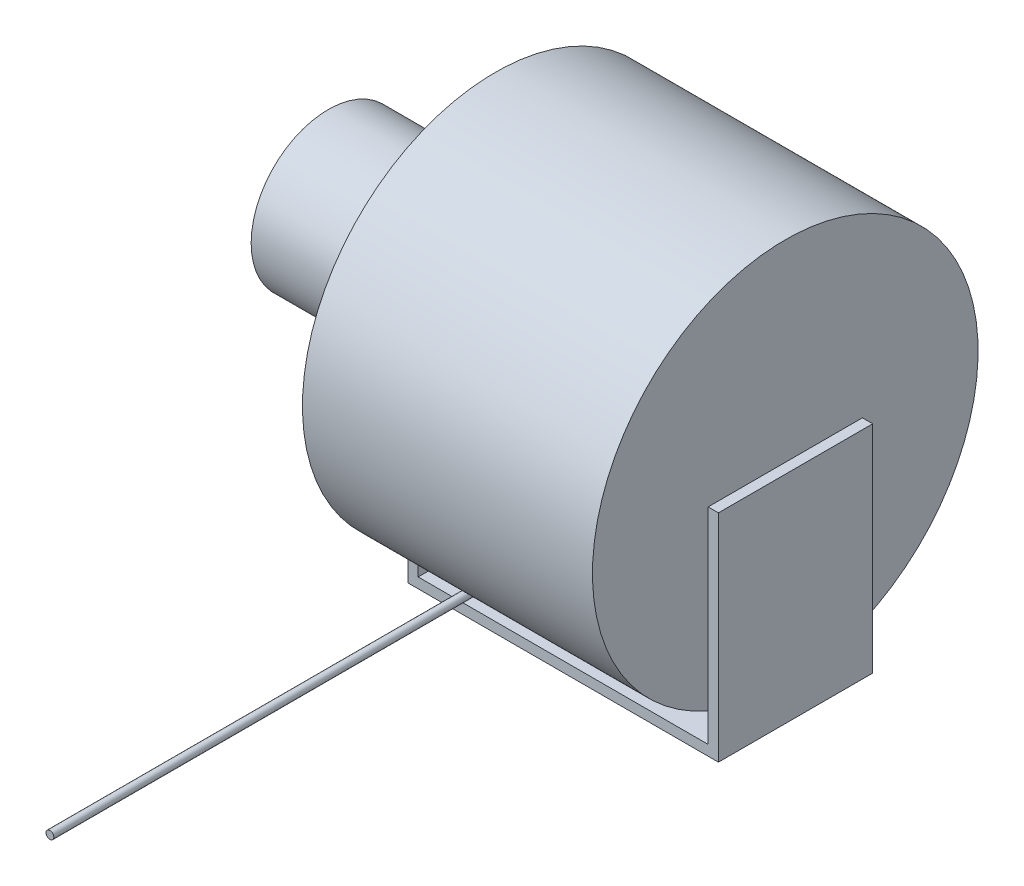
ISO-10303-21;
HEADER;
FILE_DESCRIPTION(('STEP AP214'),'2;1');
FILE_NAME('part.step','',(''),(''),'','','');
FILE_SCHEMA(('AUTOMOTIVE_DESIGN { 1 0 10303 214 1 1 1 1 }'));
ENDSEC;
DATA;
#1=APPLICATION_CONTEXT('core data for automotive mechanical design processes');
#2=APPLICATION_PROTOCOL_DEFINITION('international standard','automotive_design',2000,#1);
#3=PRODUCT_CONTEXT('',#1,'mechanical');
#4=PRODUCT('Part','Part','',(#3));
#5=PRODUCT_RELATED_PRODUCT_CATEGORY('part','',(#4));
#6=PRODUCT_DEFINITION_FORMATION('','',#4);
#7=PRODUCT_DEFINITION_CONTEXT('part definition',#1,'design');
#8=PRODUCT_DEFINITION('design','',#6,#7);
#9=PRODUCT_DEFINITION_SHAPE('','',#8);
#10=(LENGTH_UNIT() NAMED_UNIT(*) SI_UNIT(.MILLI.,.METRE.));
#11=(NAMED_UNIT(*) PLANE_ANGLE_UNIT() SI_UNIT($,.RADIAN.));
#12=(NAMED_UNIT(*) SI_UNIT($,.STERADIAN.) SOLID_ANGLE_UNIT());
#13=UNCERTAINTY_MEASURE_WITH_UNIT(LENGTH_MEASURE(1.E-05),#10,'distance_accuracy_value','');
#14=(GEOMETRIC_REPRESENTATION_CONTEXT(3) GLOBAL_UNCERTAINTY_ASSIGNED_CONTEXT((#13)) GLOBAL_UNIT_ASSIGNED_CONTEXT((#10,
#11,#12)) REPRESENTATION_CONTEXT('',''));
#15=CARTESIAN_POINT('',(0.,0.,0.));
#16=DIRECTION('',(0.,0.,1.));
#17=DIRECTION('',(1.,0.,0.));
#18=AXIS2_PLACEMENT_3D('',#15,#16,#17);
#19=CARTESIAN_POINT('',(282.,0.,0.));
#20=DIRECTION('',(-1.,0.,0.));
#21=DIRECTION('',(0.,0.,1.));
#22=AXIS2_PLACEMENT_3D('',#19,#20,#21);
#23=CYLINDRICAL_SURFACE('',#22,187.5);
#24=CARTESIAN_POINT('',(0.,0.,0.));
#25=DIRECTION('',(1.,0.,0.));
#26=DIRECTION('',(0.,0.,-1.));
#27=AXIS2_PLACEMENT_3D('',#24,#25,#26);
#28=CIRCLE('',#27,187.5);
#29=CARTESIAN_POINT('',(0.,-171.846588560844,75.));
#30=VERTEX_POINT('',#29);
#31=CARTESIAN_POINT('',(0.,-171.846588560844,-75.));
#32=VERTEX_POINT('',#31);
#33=EDGE_CURVE('E142',#30,#32,#28,.T.);
#34=ORIENTED_EDGE('',*,*,#33,.T.);
#35=EDGE_CURVE('E213',#32,#30,#28,.T.);
#36=ORIENTED_EDGE('',*,*,#35,.T.);
#37=EDGE_LOOP('',(#34,#36));
#38=FACE_BOUND('',#37,.T.);
#39=CARTESIAN_POINT('',(282.,0.,0.));
#40=DIRECTION('',(1.,0.,0.));
#41=DIRECTION('',(0.,0.,-1.));
#42=AXIS2_PLACEMENT_3D('',#39,#40,#41);
#43=CIRCLE('',#42,187.5);
#44=CARTESIAN_POINT('',(282.,-171.846588560844,75.));
#45=VERTEX_POINT('',#44);
#46=CARTESIAN_POINT('',(282.,-171.846588560844,-75.));
#47=VERTEX_POINT('',#46);
#48=EDGE_CURVE('E147',#45,#47,#43,.T.);
#49=ORIENTED_EDGE('',*,*,#48,.F.);
#50=EDGE_CURVE('E149',#47,#45,#43,.T.);
#51=ORIENTED_EDGE('',*,*,#50,.F.);
#52=EDGE_LOOP('',(#49,#51));
#53=FACE_BOUND('',#52,.T.);
#54=DIRECTION('',(-1.,0.,0.));
#55=VECTOR('',#54,1.);
#56=CARTESIAN_POINT('',(282.,-187.5,0.));
#57=LINE('',#56,#55);
#58=CARTESIAN_POINT('',(46.9,-187.5,0.));
#59=VERTEX_POINT('',#58);
#60=CARTESIAN_POINT('',(54.5,-187.5,0.));
#61=VERTEX_POINT('',#60);
#62=EDGE_CURVE('E11',#59,#61,#57,.F.);
#63=ORIENTED_EDGE('',*,*,#62,.F.);
#64=CARTESIAN_POINT('',(46.9,-187.5,0.));
#65=CARTESIAN_POINT('',(46.9000175227224,-187.500000118427,0.633424812997979));
#66=CARTESIAN_POINT('',(46.9000006280459,-187.496790188283,1.26684962907383));
#67=CARTESIAN_POINT('',(46.9000237731408,-187.483951127179,2.5336296179236));
#68=CARTESIAN_POINT('',(46.9000638125003,-187.474322042639,3.16698479116803));
#69=CARTESIAN_POINT('',(46.9003266265551,-187.44864214647,4.43373383816912));
#70=CARTESIAN_POINT('',(46.9005494499634,-187.432589623542,5.06712767722959));
#71=CARTESIAN_POINT('',(46.9014277037287,-187.394064401529,6.33372458783348));
#72=CARTESIAN_POINT('',(46.902083137326,-187.371591654358,6.96692765791251));
#73=CARTESIAN_POINT('',(46.9041686343201,-187.320207365941,8.23359033330876));
#74=CARTESIAN_POINT('',(46.9055993310942,-187.291290571403,8.86704972461046));
#75=CARTESIAN_POINT('',(46.909680058909,-187.227031872245,10.1336385259811));
#76=CARTESIAN_POINT('',(46.9123300891885,-187.191689971636,10.7667679362558));
#77=CARTESIAN_POINT('',(46.9193978177746,-187.114582757247,12.0326661754178));
#78=CARTESIAN_POINT('',(46.9238156273283,-187.072817039316,12.6654349791018));
#79=CARTESIAN_POINT('',(46.935078853708,-186.982869690701,13.9304899895));
#80=CARTESIAN_POINT('',(46.941924248713,-186.934688117692,14.5627762005009));
#81=CARTESIAN_POINT('',(46.9588277423088,-186.831910366129,15.8268578519086));
#82=CARTESIAN_POINT('',(46.9688862058321,-186.777313459383,16.4586532283927));
#83=CARTESIAN_POINT('',(46.993144654552,-186.661720468519,17.7215740820794));
#84=CARTESIAN_POINT('',(47.0073445954072,-186.600724452918,18.3526995663816));
#85=CARTESIAN_POINT('',(47.0409909484241,-186.47235320213,19.6141113214793));
#86=CARTESIAN_POINT('',(47.0604369204357,-186.404978502432,20.2443976582242));
#87=CARTESIAN_POINT('',(47.1059104672734,-186.263869446385,21.5040127127352));
#88=CARTESIAN_POINT('',(47.1319379144217,-186.190135213427,22.1333414488402));
#89=CARTESIAN_POINT('',(47.1922250260151,-186.036323744766,23.3909734988482));
#90=CARTESIAN_POINT('',(47.2264864383462,-185.956245164724,24.0192765664756));
#91=CARTESIAN_POINT('',(47.3053376479183,-185.789809595233,25.2744428144783));
#92=CARTESIAN_POINT('',(47.3499279670798,-185.703452288671,25.9013059204751));
#93=CARTESIAN_POINT('',(47.4521660307478,-185.524593796126,27.1527966565233));
#94=CARTESIAN_POINT('',(47.5098071047782,-185.432095765788,27.7774252635706));
#95=CARTESIAN_POINT('',(47.6090272384858,-185.288839581068,28.7122855507101));
#96=CARTESIAN_POINT('',(47.6442251265458,-185.240338328345,29.0235442889877));
#97=CARTESIAN_POINT('',(47.7195560669423,-185.141863222087,29.6452274269418));
#98=CARTESIAN_POINT('',(47.7596889704669,-185.091889412991,29.9556518514882));
#99=CARTESIAN_POINT('',(47.8368997166248,-185.000911234695,30.5118853593869));
#100=CARTESIAN_POINT('',(47.8729150825413,-184.960170153332,30.75788480885));
#101=CARTESIAN_POINT('',(47.9491292635967,-184.877813697329,31.2490962600432));
#102=CARTESIAN_POINT('',(47.9893281472523,-184.83619830838,31.4943082488085));
#103=CARTESIAN_POINT('',(48.0745860894121,-184.752130163623,31.9837781847891));
#104=CARTESIAN_POINT('',(48.1196457317196,-184.709677307733,32.2280360137458));
#105=CARTESIAN_POINT('',(48.2154957867499,-184.624000377655,32.7152817902279));
#106=CARTESIAN_POINT('',(48.2662858650524,-184.580776348596,32.9582698109924));
#107=CARTESIAN_POINT('',(48.380641673839,-184.488931853758,33.468766803443));
#108=CARTESIAN_POINT('',(48.4449949458466,-184.440233146771,33.7360869241299));
#109=CARTESIAN_POINT('',(48.5844146406632,-184.342215939266,34.2676280204506));
#110=CARTESIAN_POINT('',(48.659472377047,-184.292897970573,34.5318513227564));
#111=CARTESIAN_POINT('',(48.8006862682495,-184.207993296485,34.9814482347491));
#112=CARTESIAN_POINT('',(48.8633307082428,-184.172478738763,35.1679337032945));
#113=CARTESIAN_POINT('',(48.9983159304479,-184.101448430047,35.537897509482));
#114=CARTESIAN_POINT('',(49.0706762301309,-184.065932824379,35.7213689374434));
#115=CARTESIAN_POINT('',(49.1898346988285,-184.012691302289,35.9942815203375));
#116=CARTESIAN_POINT('',(49.2318073545479,-183.994767201168,36.0857890354431));
#117=CARTESIAN_POINT('',(49.3198694101712,-183.959166183016,36.2668398533476));
#118=CARTESIAN_POINT('',(49.3659576958688,-183.941489200573,36.3563836796396));
#119=CARTESIAN_POINT('',(49.4630338172272,-183.906593896846,36.5324890077432));
#120=CARTESIAN_POINT('',(49.5140048106772,-183.889374243214,36.6190594549194));
#121=CARTESIAN_POINT('',(49.6222432922106,-183.855598029672,36.7882655751723));
#122=CARTESIAN_POINT('',(49.6795040779299,-183.839040789087,36.8709053047388));
#123=CARTESIAN_POINT('',(49.7825327770056,-183.812168740642,37.004589945318));
#124=CARTESIAN_POINT('',(49.8260932202921,-183.801555574333,37.0572645070285));
#125=CARTESIAN_POINT('',(49.9178710647589,-183.781063099838,37.1587610442549));
#126=CARTESIAN_POINT('',(49.9660952442078,-183.771184897863,37.207577219042));
#127=CARTESIAN_POINT('',(50.0685668308293,-183.752462196119,37.2999313078702));
#128=CARTESIAN_POINT('',(50.1228713822368,-183.743629445886,37.3434094004902));
#129=CARTESIAN_POINT('',(50.237855072621,-183.727764398756,37.4213864989811));
#130=CARTESIAN_POINT('',(50.2985144507622,-183.72072674132,37.4559122437552));
#131=CARTESIAN_POINT('',(50.4041240396474,-183.711303231501,37.5020989119028));
#132=CARTESIAN_POINT('',(50.4473336239034,-183.708149731975,37.5175407887689));
#133=CARTESIAN_POINT('',(50.5357438274487,-183.70329469982,37.5413061287009));
#134=CARTESIAN_POINT('',(50.5809416540527,-183.701591194956,37.5496392608837));
#135=CARTESIAN_POINT('',(50.6723894459548,-183.699824183431,37.5582829443736));
#136=CARTESIAN_POINT('',(50.7186436246996,-183.699769150131,37.5585520454962));
#137=CARTESIAN_POINT('',(50.8104521898261,-183.701327357977,37.5509299446128));
#138=CARTESIAN_POINT('',(50.8560060435364,-183.702941810847,37.5430328155029));
#139=CARTESIAN_POINT('',(50.9529563631979,-183.708065366303,37.5179544398588));
#140=CARTESIAN_POINT('',(51.0039722722083,-183.71185762876,37.4993852282633));
#141=CARTESIAN_POINT('',(51.1022631436586,-183.721027228395,37.4544347247472));
#142=CARTESIAN_POINT('',(51.1495305977625,-183.72640764982,37.4280382315717));
#143=CARTESIAN_POINT('',(51.2689338423281,-183.742086032769,37.3510128401832));
#144=CARTESIAN_POINT('',(51.3378342198039,-183.753338886146,37.2956314850664));
#145=CARTESIAN_POINT('',(51.4668706691513,-183.777604667336,37.1758766975226));
#146=CARTESIAN_POINT('',(51.5269802095517,-183.79062270369,37.1114771475211));
#147=CARTESIAN_POINT('',(51.6631969289159,-183.82318515852,36.9499096360391));
#148=CARTESIAN_POINT('',(51.7359252923916,-183.843237676007,36.8500326500083));
#149=CARTESIAN_POINT('',(51.8715856667969,-183.884424651442,36.6439559446666));
#150=CARTESIAN_POINT('',(51.9344959211616,-183.905561378118,36.5377428845088));
#151=CARTESIAN_POINT('',(52.0531708060053,-183.948532035889,36.3207909940691));
#152=CARTESIAN_POINT('',(52.1088941093218,-183.97036916952,36.2100304322557));
#153=CARTESIAN_POINT('',(52.2143884169079,-184.014331885211,35.985951378689));
#154=CARTESIAN_POINT('',(52.2641656973889,-184.036457135292,35.8726357368616));
#155=CARTESIAN_POINT('',(52.3570134753616,-184.079938451611,35.6488248413724));
#156=CARTESIAN_POINT('',(52.4002765629782,-184.101288338924,35.5384076676429));
#157=CARTESIAN_POINT('',(52.4831703750277,-184.144039394178,35.3162224050906));
#158=CARTESIAN_POINT('',(52.5228006731952,-184.165440567835,35.2044541594725));
#159=CARTESIAN_POINT('',(52.6371240725397,-184.229643176143,34.8674754154609));
#160=CARTESIAN_POINT('',(52.7072074705556,-184.272423257554,34.6406960595749));
#161=CARTESIAN_POINT('',(52.8382429318745,-184.357706977801,34.18391496901));
#162=CARTESIAN_POINT('',(52.8991727982286,-184.40020971296,33.9539068343931));
#163=CARTESIAN_POINT('',(53.0136045375628,-184.484658177133,33.4920288601563));
#164=CARTESIAN_POINT('',(53.0671084039778,-184.526604052884,33.2601595379018));
#165=CARTESIAN_POINT('',(53.1681222173273,-184.609903401259,32.7946575817258));
#166=CARTESIAN_POINT('',(53.215623244458,-184.651255913208,32.5610228579916));
#167=CARTESIAN_POINT('',(53.3055181636894,-184.733237815117,32.0926374643));
#168=CARTESIAN_POINT('',(53.3479117429197,-184.773867160647,31.8578867268928));
#169=CARTESIAN_POINT('',(53.4282698370346,-184.854292221054,31.3878545701707));
#170=CARTESIAN_POINT('',(53.4662407572939,-184.894089071292,31.152574434336));
#171=CARTESIAN_POINT('',(53.5383946926477,-184.972874645442,30.681309084046));
#172=CARTESIAN_POINT('',(53.5725778003993,-185.011863389102,30.4453238869829));
#173=CARTESIAN_POINT('',(53.6695972726524,-185.126913920577,29.7405618070246));
#174=CARTESIAN_POINT('',(53.7275800303813,-185.201755412631,29.2709146250601));
#175=CARTESIAN_POINT('',(53.8332312970167,-185.348030681144,28.3299189267903));
#176=CARTESIAN_POINT('',(53.8808989506923,-185.419464174661,27.8585702727063));
#177=CARTESIAN_POINT('',(53.9678299190339,-185.558857573174,26.9144595245939));
#178=CARTESIAN_POINT('',(54.0070909186989,-185.626816517447,26.4416970774876));
#179=CARTESIAN_POINT('',(54.0786427497759,-185.759187727515,25.4951477531516));
#180=CARTESIAN_POINT('',(54.1109334559304,-185.823599929558,25.0213608576668));
#181=CARTESIAN_POINT('',(54.1697271731635,-185.948938324953,24.0722212111215));
#182=CARTESIAN_POINT('',(54.1962211376025,-186.009858961409,23.5968671712886));
#183=CARTESIAN_POINT('',(54.244277233824,-186.12808187043,22.6454618513612));
#184=CARTESIAN_POINT('',(54.2658393340886,-186.185384119871,22.1694105668305));
#185=CARTESIAN_POINT('',(54.3243033441746,-186.351818500837,20.7405232544149));
#186=CARTESIAN_POINT('',(54.3549924064492,-186.455499599403,19.7867922324586));
#187=CARTESIAN_POINT('',(54.4046147613279,-186.648140087385,17.8784975336502));
#188=CARTESIAN_POINT('',(54.4235593490669,-186.737113561119,16.9239355437418));
#189=CARTESIAN_POINT('',(54.4533173555961,-186.900420018983,15.0134015427882));
#190=CARTESIAN_POINT('',(54.4641304614161,-186.974752439515,14.0574294788898));
#191=CARTESIAN_POINT('',(54.4803998273852,-187.108698188618,12.1450888462044));
#192=CARTESIAN_POINT('',(54.4858598366853,-187.168321796872,11.1887210249105));
#193=CARTESIAN_POINT('',(54.4935706338797,-187.272899408096,9.27519508450845));
#194=CARTESIAN_POINT('',(54.4958215078482,-187.317853804491,8.31803698728574));
#195=CARTESIAN_POINT('',(54.4981657607286,-187.379564543228,6.74726307546603));
#196=CARTESIAN_POINT('',(54.4987438041654,-187.400648561466,6.13381430263631));
#197=CARTESIAN_POINT('',(54.4995174873015,-187.436792687155,4.90668560401493));
#198=CARTESIAN_POINT('',(54.4997130944956,-187.451852282475,4.29300566300855));
#199=CARTESIAN_POINT('',(54.4999437977356,-187.475932022045,3.06610819955007));
#200=CARTESIAN_POINT('',(54.4999790453985,-187.484957864211,2.45289078861801));
#201=CARTESIAN_POINT('',(54.4999995194668,-187.496991646609,1.22644897083613));
#202=CARTESIAN_POINT('',(54.4999847501174,-187.500000097534,0.61322456899734));
#203=CARTESIAN_POINT('',(54.5,-187.5,0.));
#204=B_SPLINE_CURVE_WITH_KNOTS('',3,(#64,#65,#66,#67,#68,#69,#70,#71,#72,#73,#74,#75,#76,#77,
#78,#79,#80,#81,#82,#83,#84,#85,#86,#87,#88,#89,#90,#91,#92,#93,#94,#95,#96,#97,#98,#99,#100,
#101,#102,#103,#104,#105,#106,#107,#108,#109,#110,#111,#112,#113,#114,#115,#116,#117,#118,#119,
#120,#121,#122,#123,#124,#125,#126,#127,#128,#129,#130,#131,#132,#133,#134,#135,#136,#137,#138,
#139,#140,#141,#142,#143,#144,#145,#146,#147,#148,#149,#150,#151,#152,#153,#154,#155,#156,#157,
#158,#159,#160,#161,#162,#163,#164,#165,#166,#167,#168,#169,#170,#171,#172,#173,#174,#175,#176,
#177,#178,#179,#180,#181,#182,#183,#184,#185,#186,#187,#188,#189,#190,#191,#192,#193,#194,#195,
#196,#197,#198,#199,#200,#201,#202,#203),.UNSPECIFIED.,.F.,.F.,(4,2,2,2,2,2,2,2,2,2,2,2,2,2,2,2,
2,2,2,2,2,2,2,2,2,2,2,2,2,2,2,2,2,2,2,2,2,2,2,2,2,2,2,2,2,2,2,2,2,2,2,2,2,2,2,2,2,2,2,2,2,2,2,2,
2,2,2,2,2,4),(0.,1.90026631167775,3.80051888167974,5.70127804428522,7.6020514436584,
9.50438009014794,11.4067075491884,13.3091547415195,15.2115848335866,17.1142310758594,
19.0168569478548,20.9193232361977,22.8217526203241,24.7245862047824,26.6275159605883,
28.529475281576,29.4803675650246,30.431231182003,31.1870132094228,31.9428076167978,
32.6986929004128,33.4545340944124,34.2920844883322,35.1289590563116,35.7285112162394,
36.3292863123395,36.6359832360465,36.9425973793343,37.2481895764387,37.553459238716,
37.7607799568474,37.9684066573916,38.1781810433251,38.3873214630056,38.5247884807994,
38.6620682202876,38.8000534753876,38.9381389514435,39.100497372572,39.2631731962266,
39.5289970952799,39.7956074113679,40.17018178823,40.5455747698304,40.9230383127001,
41.3000998429468,41.6615151421001,42.0229727949825,42.7462329904587,43.4712196946501,
44.1960114054876,44.9218677501523,45.647768536518,46.372604566047,47.0974228608094,
48.5345306149835,49.9717574749281,51.4093796068324,52.8470275709239,54.2869034336919,
55.726788497964,58.6060691194884,61.482576307272,64.3591942024195,67.2337959569101,
70.1083206086052,71.9497277782476,73.7912914511951,75.6311135954876,77.470779588625),.UNSPECIFIED.);
#205=EDGE_CURVE('E47',#59,#61,#204,.T.);
#206=ORIENTED_EDGE('',*,*,#205,.T.);
#207=EDGE_LOOP('',(#63,#206));
#208=FACE_BOUND('',#207,.T.);
#209=ADVANCED_FACE('F39',(#38,#53,#208),#23,.T.);
#210=CARTESIAN_POINT('',(0.,0.,0.));
#211=DIRECTION('',(-1.,0.,0.));
#212=DIRECTION('',(0.,0.,1.));
#213=AXIS2_PLACEMENT_3D('',#210,#211,#212);
#214=PLANE('',#213);
#215=DIRECTION('',(0.,0.,1.));
#216=VECTOR('',#215,1.);
#217=CARTESIAN_POINT('',(0.,-200.,-75.));
#218=LINE('',#217,#216);
#219=CARTESIAN_POINT('',(0.,-200.,-75.));
#220=VERTEX_POINT('',#219);
#221=CARTESIAN_POINT('',(0.,-200.,75.));
#222=VERTEX_POINT('',#221);
#223=EDGE_CURVE('E60',#220,#222,#218,.T.);
#224=ORIENTED_EDGE('',*,*,#223,.F.);
#225=DIRECTION('',(0.,-1.,0.));
#226=VECTOR('',#225,1.);
#227=CARTESIAN_POINT('',(0.,0.,-75.));
#228=LINE('',#227,#226);
#229=EDGE_CURVE('E184',#32,#220,#228,.T.);
#230=ORIENTED_EDGE('',*,*,#229,.F.);
#231=ORIENTED_EDGE('',*,*,#33,.F.);
#232=DIRECTION('',(0.,1.,0.));
#233=VECTOR('',#232,1.);
#234=CARTESIAN_POINT('',(0.,0.,75.));
#235=LINE('',#234,#233);
#236=EDGE_CURVE('E201',#222,#30,#235,.T.);
#237=ORIENTED_EDGE('',*,*,#236,.F.);
#238=EDGE_LOOP('',(#224,#230,#231,#237));
#239=FACE_BOUND('',#238,.T.);
#240=ADVANCED_FACE('F130',(#239),#214,.F.);
#241=CARTESIAN_POINT('',(282.,0.,0.));
#242=DIRECTION('',(1.,0.,0.));
#243=DIRECTION('',(0.,0.,-1.));
#244=AXIS2_PLACEMENT_3D('',#241,#242,#243);
#245=PLANE('',#244);
#246=DIRECTION('',(0.,0.,1.));
#247=VECTOR('',#246,1.);
#248=CARTESIAN_POINT('',(282.,-200.,-75.));
#249=LINE('',#248,#247);
#250=CARTESIAN_POINT('',(282.,-200.,-75.));
#251=VERTEX_POINT('',#250);
#252=CARTESIAN_POINT('',(282.,-200.,75.));
#253=VERTEX_POINT('',#252);
#254=EDGE_CURVE('E159',#251,#253,#249,.T.);
#255=ORIENTED_EDGE('',*,*,#254,.T.);
#256=DIRECTION('',(0.,-1.,0.));
#257=VECTOR('',#256,1.);
#258=CARTESIAN_POINT('',(282.,0.,75.));
#259=LINE('',#258,#257);
#260=EDGE_CURVE('E156',#45,#253,#259,.T.);
#261=ORIENTED_EDGE('',*,*,#260,.F.);
#262=ORIENTED_EDGE('',*,*,#48,.T.);
#263=DIRECTION('',(0.,1.,0.));
#264=VECTOR('',#263,1.);
#265=CARTESIAN_POINT('',(282.,0.,-75.));
#266=LINE('',#265,#264);
#267=EDGE_CURVE('E170',#251,#47,#266,.T.);
#268=ORIENTED_EDGE('',*,*,#267,.F.);
#269=EDGE_LOOP('',(#255,#261,#262,#268));
#270=FACE_BOUND('',#269,.T.);
#271=ADVANCED_FACE('F135',(#270),#245,.F.);
#272=CARTESIAN_POINT('',(0.,0.,0.));
#273=DIRECTION('',(1.,0.,0.));
#274=DIRECTION('',(0.,0.,-1.));
#275=AXIS2_PLACEMENT_3D('',#272,#273,#274);
#276=PLANE('',#275);
#277=CARTESIAN_POINT('',(0.,0.,-75.));
#278=VERTEX_POINT('',#277);
#279=EDGE_CURVE('E198',#278,#32,#228,.T.);
#280=ORIENTED_EDGE('',*,*,#279,.F.);
#281=DIRECTION('',(0.,0.,-1.));
#282=VECTOR('',#281,1.);
#283=CARTESIAN_POINT('',(0.,0.,-75.));
#284=LINE('',#283,#282);
#285=CARTESIAN_POINT('',(0.,0.,75.));
#286=VERTEX_POINT('',#285);
#287=EDGE_CURVE('E189',#286,#278,#284,.T.);
#288=ORIENTED_EDGE('',*,*,#287,.F.);
#289=EDGE_CURVE('E152',#30,#286,#235,.T.);
#290=ORIENTED_EDGE('',*,*,#289,.F.);
#291=ORIENTED_EDGE('',*,*,#35,.F.);
#292=EDGE_LOOP('',(#280,#288,#290,#291));
#293=FACE_BOUND('',#292,.T.);
#294=ADVANCED_FACE('F249',(#293),#276,.F.);
#295=CARTESIAN_POINT('',(282.,0.,0.));
#296=DIRECTION('',(1.,0.,0.));
#297=DIRECTION('',(0.,0.,-1.));
#298=AXIS2_PLACEMENT_3D('',#295,#296,#297);
#299=PLANE('',#298);
#300=CARTESIAN_POINT('',(282.,0.,75.));
#301=VERTEX_POINT('',#300);
#302=EDGE_CURVE('E161',#301,#45,#259,.T.);
#303=ORIENTED_EDGE('',*,*,#302,.F.);
#304=DIRECTION('',(0.,0.,1.));
#305=VECTOR('',#304,1.);
#306=CARTESIAN_POINT('',(282.,0.,75.));
#307=LINE('',#306,#305);
#308=CARTESIAN_POINT('',(282.,0.,-75.));
#309=VERTEX_POINT('',#308);
#310=EDGE_CURVE('E171',#309,#301,#307,.T.);
#311=ORIENTED_EDGE('',*,*,#310,.F.);
#312=EDGE_CURVE('E173',#47,#309,#266,.T.);
#313=ORIENTED_EDGE('',*,*,#312,.F.);
#314=ORIENTED_EDGE('',*,*,#50,.T.);
#315=EDGE_LOOP('',(#303,#311,#313,#314));
#316=FACE_BOUND('',#315,.T.);
#317=ADVANCED_FACE('F270',(#316),#299,.T.);
#318=CARTESIAN_POINT('',(-10.,0.,-75.));
#319=DIRECTION('',(0.,0.,1.));
#320=DIRECTION('',(0.,-1.,0.));
#321=AXIS2_PLACEMENT_3D('',#318,#319,#320);
#322=PLANE('',#321);
#323=ORIENTED_EDGE('',*,*,#279,.T.);
#324=ORIENTED_EDGE('',*,*,#229,.T.);
#325=DIRECTION('',(-1.,0.,0.));
#326=VECTOR('',#325,1.);
#327=CARTESIAN_POINT('',(292.002,-200.,-75.));
#328=LINE('',#327,#326);
#329=EDGE_CURVE('E299',#251,#220,#328,.T.);
#330=ORIENTED_EDGE('',*,*,#329,.F.);
#331=ORIENTED_EDGE('',*,*,#267,.T.);
#332=ORIENTED_EDGE('',*,*,#312,.T.);
#333=DIRECTION('',(-1.,0.,0.));
#334=VECTOR('',#333,1.);
#335=CARTESIAN_POINT('',(292.,0.,-75.));
#336=LINE('',#335,#334);
#337=CARTESIAN_POINT('',(292.,0.,-75.));
#338=VERTEX_POINT('',#337);
#339=EDGE_CURVE('E181',#338,#309,#336,.T.);
#340=ORIENTED_EDGE('',*,*,#339,.F.);
#341=DIRECTION('',(0.,1.,0.));
#342=VECTOR('',#341,1.);
#343=CARTESIAN_POINT('',(292.,0.,-75.));
#344=LINE('',#343,#342);
#345=CARTESIAN_POINT('',(292.,-210.,-75.));
#346=VERTEX_POINT('',#345);
#347=EDGE_CURVE('E309',#346,#338,#344,.T.);
#348=ORIENTED_EDGE('',*,*,#347,.F.);
#349=DIRECTION('',(1.,0.,0.));
#350=VECTOR('',#349,1.);
#351=CARTESIAN_POINT('',(-10.,-210.,-75.));
#352=LINE('',#351,#350);
#353=CARTESIAN_POINT('',(-10.,-210.,-75.));
#354=VERTEX_POINT('',#353);
#355=EDGE_CURVE('E212',#354,#346,#352,.T.);
#356=ORIENTED_EDGE('',*,*,#355,.F.);
#357=DIRECTION('',(0.,-1.,0.));
#358=VECTOR('',#357,1.);
#359=CARTESIAN_POINT('',(-10.,0.,-75.));
#360=LINE('',#359,#358);
#361=CARTESIAN_POINT('',(-10.,0.,-75.));
#362=VERTEX_POINT('',#361);
#363=EDGE_CURVE('E185',#362,#354,#360,.T.);
#364=ORIENTED_EDGE('',*,*,#363,.F.);
#365=DIRECTION('',(1.,0.,0.));
#366=VECTOR('',#365,1.);
#367=CARTESIAN_POINT('',(-10.,0.,-75.));
#368=LINE('',#367,#366);
#369=EDGE_CURVE('E197',#362,#278,#368,.T.);
#370=ORIENTED_EDGE('',*,*,#369,.T.);
#371=EDGE_LOOP('',(#323,#324,#330,#331,#332,#340,#348,#356,#364,#370));
#372=FACE_BOUND('',#371,.T.);
#373=ADVANCED_FACE('F266',(#372),#322,.F.);
#374=CARTESIAN_POINT('',(-10.,-210.,-75.));
#375=DIRECTION('',(0.,1.,0.));
#376=DIRECTION('',(0.,0.,1.));
#377=AXIS2_PLACEMENT_3D('',#374,#375,#376);
#378=PLANE('',#377);
#379=ORIENTED_EDGE('',*,*,#355,.T.);
#380=DIRECTION('',(0.,0.,-1.));
#381=VECTOR('',#380,1.);
#382=CARTESIAN_POINT('',(292.,-210.,75.));
#383=LINE('',#382,#381);
#384=CARTESIAN_POINT('',(292.,-210.,75.));
#385=VERTEX_POINT('',#384);
#386=EDGE_CURVE('E307',#385,#346,#383,.T.);
#387=ORIENTED_EDGE('',*,*,#386,.F.);
#388=DIRECTION('',(1.,0.,0.));
#389=VECTOR('',#388,1.);
#390=CARTESIAN_POINT('',(-10.,-210.,75.));
#391=LINE('',#390,#389);
#392=CARTESIAN_POINT('',(-10.,-210.,75.));
#393=VERTEX_POINT('',#392);
#394=EDGE_CURVE('E210',#393,#385,#391,.T.);
#395=ORIENTED_EDGE('',*,*,#394,.F.);
#396=DIRECTION('',(0.,0.,1.));
#397=VECTOR('',#396,1.);
#398=CARTESIAN_POINT('',(-10.,-210.,-75.));
#399=LINE('',#398,#397);
#400=EDGE_CURVE('E188',#354,#393,#399,.T.);
#401=ORIENTED_EDGE('',*,*,#400,.F.);
#402=EDGE_LOOP('',(#379,#387,#395,#401));
#403=FACE_BOUND('',#402,.T.);
#404=ADVANCED_FACE('F263',(#403),#378,.F.);
#405=CARTESIAN_POINT('',(-10.,0.,75.));
#406=DIRECTION('',(0.,0.,-1.));
#407=DIRECTION('',(-1.,0.,0.));
#408=AXIS2_PLACEMENT_3D('',#405,#406,#407);
#409=PLANE('',#408);
#410=ORIENTED_EDGE('',*,*,#394,.T.);
#411=DIRECTION('',(0.,-1.,0.));
#412=VECTOR('',#411,1.);
#413=CARTESIAN_POINT('',(292.,0.,75.));
#414=LINE('',#413,#412);
#415=CARTESIAN_POINT('',(292.,0.,75.));
#416=VERTEX_POINT('',#415);
#417=EDGE_CURVE('E179',#416,#385,#414,.T.);
#418=ORIENTED_EDGE('',*,*,#417,.F.);
#419=DIRECTION('',(-1.,0.,0.));
#420=VECTOR('',#419,1.);
#421=CARTESIAN_POINT('',(292.,0.,75.));
#422=LINE('',#421,#420);
#423=EDGE_CURVE('E167',#416,#301,#422,.T.);
#424=ORIENTED_EDGE('',*,*,#423,.T.);
#425=ORIENTED_EDGE('',*,*,#302,.T.);
#426=ORIENTED_EDGE('',*,*,#260,.T.);
#427=DIRECTION('',(-1.,0.,0.));
#428=VECTOR('',#427,1.);
#429=CARTESIAN_POINT('',(292.002,-200.,75.));
#430=LINE('',#429,#428);
#431=EDGE_CURVE('E300',#253,#222,#430,.T.);
#432=ORIENTED_EDGE('',*,*,#431,.T.);
#433=ORIENTED_EDGE('',*,*,#236,.T.);
#434=ORIENTED_EDGE('',*,*,#289,.T.);
#435=DIRECTION('',(1.,0.,0.));
#436=VECTOR('',#435,1.);
#437=CARTESIAN_POINT('',(-10.,0.,75.));
#438=LINE('',#437,#436);
#439=CARTESIAN_POINT('',(-10.,0.,75.));
#440=VERTEX_POINT('',#439);
#441=EDGE_CURVE('E207',#440,#286,#438,.T.);
#442=ORIENTED_EDGE('',*,*,#441,.F.);
#443=DIRECTION('',(0.,1.,0.));
#444=VECTOR('',#443,1.);
#445=CARTESIAN_POINT('',(-10.,0.,75.));
#446=LINE('',#445,#444);
#447=EDGE_CURVE('E191',#393,#440,#446,.T.);
#448=ORIENTED_EDGE('',*,*,#447,.F.);
#449=EDGE_LOOP('',(#410,#418,#424,#425,#426,#432,#433,#434,#442,#448));
#450=FACE_BOUND('',#449,.T.);
#451=ADVANCED_FACE('F164',(#450),#409,.F.);
#452=CARTESIAN_POINT('',(-10.,0.,-75.));
#453=DIRECTION('',(0.,-1.,0.));
#454=DIRECTION('',(0.,0.,-1.));
#455=AXIS2_PLACEMENT_3D('',#452,#453,#454);
#456=PLANE('',#455);
#457=ORIENTED_EDGE('',*,*,#287,.T.);
#458=ORIENTED_EDGE('',*,*,#369,.F.);
#459=DIRECTION('',(0.,0.,-1.));
#460=VECTOR('',#459,1.);
#461=CARTESIAN_POINT('',(-10.,0.,-75.));
#462=LINE('',#461,#460);
#463=EDGE_CURVE('E194',#440,#362,#462,.T.);
#464=ORIENTED_EDGE('',*,*,#463,.F.);
#465=ORIENTED_EDGE('',*,*,#441,.T.);
#466=EDGE_LOOP('',(#457,#458,#464,#465));
#467=FACE_BOUND('',#466,.T.);
#468=ADVANCED_FACE('F255',(#467),#456,.F.);
#469=CARTESIAN_POINT('',(-10.,0.,0.));
#470=DIRECTION('',(-1.,0.,0.));
#471=DIRECTION('',(0.,0.,1.));
#472=AXIS2_PLACEMENT_3D('',#469,#470,#471);
#473=PLANE('',#472);
#474=CARTESIAN_POINT('',(-10.,0.,0.));
#475=DIRECTION('',(-1.,0.,0.));
#476=DIRECTION('',(0.,0.,1.));
#477=AXIS2_PLACEMENT_3D('',#474,#475,#476);
#478=CIRCLE('',#477,75.);
#479=EDGE_CURVE('E123',#362,#440,#478,.T.);
#480=ORIENTED_EDGE('',*,*,#479,.F.);
#481=ORIENTED_EDGE('',*,*,#363,.T.);
#482=ORIENTED_EDGE('',*,*,#400,.T.);
#483=ORIENTED_EDGE('',*,*,#447,.T.);
#484=EDGE_LOOP('',(#480,#481,#482,#483));
#485=FACE_BOUND('',#484,.T.);
#486=ADVANCED_FACE('F252',(#485),#473,.T.);
#487=CARTESIAN_POINT('',(292.,0.,75.));
#488=DIRECTION('',(0.,-1.,0.));
#489=DIRECTION('',(0.,0.,-1.));
#490=AXIS2_PLACEMENT_3D('',#487,#488,#489);
#491=PLANE('',#490);
#492=ORIENTED_EDGE('',*,*,#310,.T.);
#493=ORIENTED_EDGE('',*,*,#423,.F.);
#494=DIRECTION('',(0.,0.,1.));
#495=VECTOR('',#494,1.);
#496=CARTESIAN_POINT('',(292.,0.,75.));
#497=LINE('',#496,#495);
#498=EDGE_CURVE('E175',#338,#416,#497,.T.);
#499=ORIENTED_EDGE('',*,*,#498,.F.);
#500=ORIENTED_EDGE('',*,*,#339,.T.);
#501=EDGE_LOOP('',(#492,#493,#499,#500));
#502=FACE_BOUND('',#501,.T.);
#503=ADVANCED_FACE('F245',(#502),#491,.F.);
#504=CARTESIAN_POINT('',(292.,0.,0.));
#505=DIRECTION('',(1.,0.,0.));
#506=DIRECTION('',(0.,0.,-1.));
#507=AXIS2_PLACEMENT_3D('',#504,#505,#506);
#508=PLANE('',#507);
#509=ORIENTED_EDGE('',*,*,#417,.T.);
#510=ORIENTED_EDGE('',*,*,#386,.T.);
#511=ORIENTED_EDGE('',*,*,#347,.T.);
#512=ORIENTED_EDGE('',*,*,#498,.T.);
#513=EDGE_LOOP('',(#509,#510,#511,#512));
#514=FACE_BOUND('',#513,.T.);
#515=ADVANCED_FACE('F242',(#514),#508,.T.);
#516=CARTESIAN_POINT('',(292.002,-200.,-75.));
#517=DIRECTION('',(0.,-1.,0.));
#518=DIRECTION('',(0.,0.,-1.));
#519=AXIS2_PLACEMENT_3D('',#516,#517,#518);
#520=PLANE('',#519);
#521=ORIENTED_EDGE('',*,*,#254,.F.);
#522=ORIENTED_EDGE('',*,*,#329,.T.);
#523=ORIENTED_EDGE('',*,*,#223,.T.);
#524=ORIENTED_EDGE('',*,*,#431,.F.);
#525=EDGE_LOOP('',(#521,#522,#523,#524));
#526=FACE_BOUND('',#525,.T.);
#527=ADVANCED_FACE('F235',(#526),#520,.F.);
#528=CARTESIAN_POINT('',(-10.,0.,0.));
#529=DIRECTION('',(-1.,0.,0.));
#530=DIRECTION('',(0.,0.,1.));
#531=AXIS2_PLACEMENT_3D('',#528,#529,#530);
#532=PLANE('',#531);
#533=EDGE_CURVE('E126',#440,#362,#478,.T.);
#534=ORIENTED_EDGE('',*,*,#533,.F.);
#535=ORIENTED_EDGE('',*,*,#463,.T.);
#536=EDGE_LOOP('',(#534,#535));
#537=FACE_BOUND('',#536,.T.);
#538=ADVANCED_FACE('F232',(#537),#532,.F.);
#539=CARTESIAN_POINT('',(-162.4,0.,0.));
#540=DIRECTION('',(1.,0.,0.));
#541=DIRECTION('',(0.,0.,-1.));
#542=AXIS2_PLACEMENT_3D('',#539,#540,#541);
#543=CYLINDRICAL_SURFACE('',#542,75.);
#544=CARTESIAN_POINT('',(-162.4,0.,0.));
#545=DIRECTION('',(-1.,0.,0.));
#546=DIRECTION('',(0.,0.,1.));
#547=AXIS2_PLACEMENT_3D('',#544,#545,#546);
#548=CIRCLE('',#547,75.);
#549=CARTESIAN_POINT('',(-162.4,0.,75.));
#550=VERTEX_POINT('',#549);
#551=EDGE_CURVE('E289',#550,#550,#548,.T.);
#552=ORIENTED_EDGE('',*,*,#551,.F.);
#553=EDGE_LOOP('',(#552));
#554=FACE_BOUND('',#553,.T.);
#555=ORIENTED_EDGE('',*,*,#533,.T.);
#556=ORIENTED_EDGE('',*,*,#479,.T.);
#557=EDGE_LOOP('',(#555,#556));
#558=FACE_BOUND('',#557,.T.);
#559=ADVANCED_FACE('F230',(#554,#558),#543,.T.);
#560=CARTESIAN_POINT('',(-162.4,0.,0.));
#561=DIRECTION('',(-1.,0.,0.));
#562=DIRECTION('',(0.,0.,1.));
#563=AXIS2_PLACEMENT_3D('',#560,#561,#562);
#564=PLANE('',#563);
#565=ORIENTED_EDGE('',*,*,#551,.T.);
#566=EDGE_LOOP('',(#565));
#567=FACE_BOUND('',#566,.T.);
#568=ADVANCED_FACE('F227',(#567),#564,.T.);
#569=CARTESIAN_POINT('',(50.7,-187.5,0.));
#570=DIRECTION('',(0.,0.,1.));
#571=DIRECTION('',(1.,0.,0.));
#572=AXIS2_PLACEMENT_3D('',#569,#570,#571);
#573=PLANE('',#572);
#574=CARTESIAN_POINT('',(50.7,-187.5,0.));
#575=DIRECTION('',(0.,0.,1.));
#576=DIRECTION('',(1.,0.,0.));
#577=AXIS2_PLACEMENT_3D('',#574,#575,#576);
#578=CIRCLE('',#577,3.8);
#579=EDGE_CURVE('E53',#59,#61,#578,.T.);
#580=ORIENTED_EDGE('',*,*,#579,.F.);
#581=ORIENTED_EDGE('',*,*,#62,.T.);
#582=EDGE_LOOP('',(#580,#581));
#583=FACE_BOUND('',#582,.T.);
#584=ADVANCED_FACE('F125',(#583),#573,.F.);
#585=CARTESIAN_POINT('',(50.7,-187.5,0.));
#586=DIRECTION('',(0.,0.,1.));
#587=DIRECTION('',(0.,-1.,0.));
#588=AXIS2_PLACEMENT_3D('',#585,#586,#587);
#589=CYLINDRICAL_SURFACE('',#588,3.8);
#590=ORIENTED_EDGE('',*,*,#205,.F.);
#591=ORIENTED_EDGE('',*,*,#579,.T.);
#592=EDGE_LOOP('',(#590,#591));
#593=FACE_BOUND('',#592,.T.);
#594=CARTESIAN_POINT('',(50.7,-187.5,483.8));
#595=DIRECTION('',(0.,0.,1.));
#596=DIRECTION('',(1.,0.,0.));
#597=AXIS2_PLACEMENT_3D('',#594,#595,#596);
#598=CIRCLE('',#597,3.79999999999999);
#599=CARTESIAN_POINT('',(54.5,-187.5,483.8));
#600=VERTEX_POINT('',#599);
#601=EDGE_CURVE('E127',#600,#600,#598,.T.);
#602=ORIENTED_EDGE('',*,*,#601,.F.);
#603=EDGE_LOOP('',(#602));
#604=FACE_BOUND('',#603,.T.);
#605=ADVANCED_FACE('F119',(#593,#604),#589,.T.);
#606=CARTESIAN_POINT('',(50.7,-187.5,483.8));
#607=DIRECTION('',(0.,0.,1.));
#608=DIRECTION('',(1.,0.,0.));
#609=AXIS2_PLACEMENT_3D('',#606,#607,#608);
#610=PLANE('',#609);
#611=ORIENTED_EDGE('',*,*,#601,.T.);
#612=EDGE_LOOP('',(#611));
#613=FACE_BOUND('',#612,.T.);
#614=ADVANCED_FACE('F224',(#613),#610,.T.);
#615=CLOSED_SHELL('',(#209,#240,#271,#294,#317,#373,#404,#451,#468,#486,#503,#515,#527,#538,
#559,#568,#584,#605,#614));
#616=MANIFOLD_SOLID_BREP('B2',#615);
#617=ADVANCED_BREP_SHAPE_REPRESENTATION('',(#18,#616),#14);
#618=SHAPE_DEFINITION_REPRESENTATION(#9,#617);
ENDSEC;
END-ISO-10303-21;
